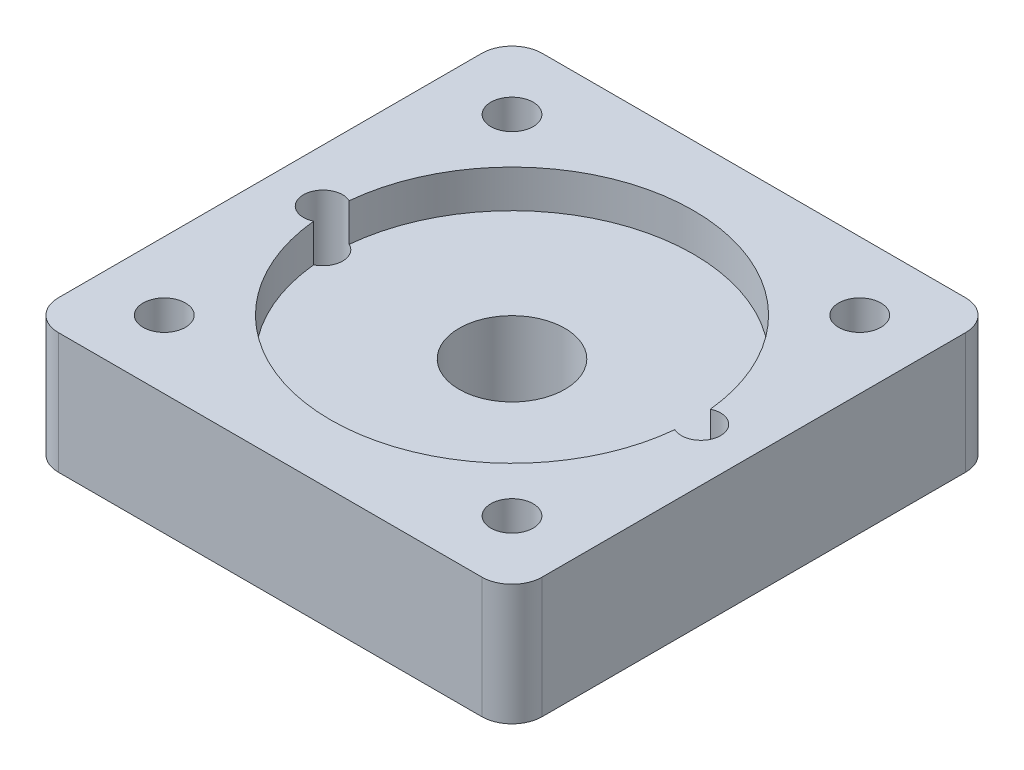
ISO-10303-21;
HEADER;
FILE_DESCRIPTION(('STEP AP214'),'2;1');
FILE_NAME('part.step','',(''),(''),'','','');
FILE_SCHEMA(('AUTOMOTIVE_DESIGN { 1 0 10303 214 1 1 1 1 }'));
ENDSEC;
DATA;
#1=APPLICATION_CONTEXT('core data for automotive mechanical design processes');
#2=APPLICATION_PROTOCOL_DEFINITION('international standard','automotive_design',2000,#1);
#3=PRODUCT_CONTEXT('',#1,'mechanical');
#4=PRODUCT('Part','Part','',(#3));
#5=PRODUCT_RELATED_PRODUCT_CATEGORY('part','',(#4));
#6=PRODUCT_DEFINITION_FORMATION('','',#4);
#7=PRODUCT_DEFINITION_CONTEXT('part definition',#1,'design');
#8=PRODUCT_DEFINITION('design','',#6,#7);
#9=PRODUCT_DEFINITION_SHAPE('','',#8);
#10=(LENGTH_UNIT() NAMED_UNIT(*) SI_UNIT(.MILLI.,.METRE.));
#11=(NAMED_UNIT(*) PLANE_ANGLE_UNIT() SI_UNIT($,.RADIAN.));
#12=(NAMED_UNIT(*) SI_UNIT($,.STERADIAN.) SOLID_ANGLE_UNIT());
#13=UNCERTAINTY_MEASURE_WITH_UNIT(LENGTH_MEASURE(1.E-05),#10,'distance_accuracy_value','');
#14=(GEOMETRIC_REPRESENTATION_CONTEXT(3) GLOBAL_UNCERTAINTY_ASSIGNED_CONTEXT((#13)) GLOBAL_UNIT_ASSIGNED_CONTEXT((#10,
#11,#12)) REPRESENTATION_CONTEXT('',''));
#15=CARTESIAN_POINT('',(0.,0.,0.));
#16=DIRECTION('',(0.,0.,1.));
#17=DIRECTION('',(1.,0.,0.));
#18=AXIS2_PLACEMENT_3D('',#15,#16,#17);
#19=CARTESIAN_POINT('',(4.5,8.,-27.5));
#20=DIRECTION('',(0.,-1.,0.));
#21=DIRECTION('',(0.,0.,-1.));
#22=AXIS2_PLACEMENT_3D('',#19,#20,#21);
#23=CYLINDRICAL_SURFACE('',#22,1.4);
#24=CARTESIAN_POINT('',(4.5,8.,-27.5));
#25=DIRECTION('',(0.,1.,0.));
#26=DIRECTION('',(0.,0.,1.));
#27=AXIS2_PLACEMENT_3D('',#24,#25,#26);
#28=CIRCLE('',#27,1.4);
#29=CARTESIAN_POINT('',(4.5,8.,-26.1));
#30=VERTEX_POINT('',#29);
#31=EDGE_CURVE('E188',#30,#30,#28,.T.);
#32=ORIENTED_EDGE('',*,*,#31,.T.);
#33=EDGE_LOOP('',(#32));
#34=FACE_BOUND('',#33,.T.);
#35=CARTESIAN_POINT('',(4.5,3.,-27.5));
#36=DIRECTION('',(0.,-1.,0.));
#37=DIRECTION('',(0.,0.,-1.));
#38=AXIS2_PLACEMENT_3D('',#35,#36,#37);
#39=CIRCLE('',#38,1.4);
#40=CARTESIAN_POINT('',(4.5,3.,-28.9));
#41=VERTEX_POINT('',#40);
#42=EDGE_CURVE('E48',#41,#41,#39,.T.);
#43=ORIENTED_EDGE('',*,*,#42,.T.);
#44=EDGE_LOOP('',(#43));
#45=FACE_BOUND('',#44,.T.);
#46=ADVANCED_FACE('F44',(#34,#45),#23,.F.);
#47=CARTESIAN_POINT('',(27.5,8.,-27.5));
#48=DIRECTION('',(0.,-1.,0.));
#49=DIRECTION('',(0.,0.,-1.));
#50=AXIS2_PLACEMENT_3D('',#47,#48,#49);
#51=CYLINDRICAL_SURFACE('',#50,1.4);
#52=CARTESIAN_POINT('',(27.5,8.,-27.5));
#53=DIRECTION('',(0.,1.,0.));
#54=DIRECTION('',(0.,0.,-1.));
#55=AXIS2_PLACEMENT_3D('',#52,#53,#54);
#56=CIRCLE('',#55,1.4);
#57=CARTESIAN_POINT('',(27.5,8.,-28.9));
#58=VERTEX_POINT('',#57);
#59=EDGE_CURVE('E184',#58,#58,#56,.T.);
#60=ORIENTED_EDGE('',*,*,#59,.T.);
#61=EDGE_LOOP('',(#60));
#62=FACE_BOUND('',#61,.T.);
#63=CARTESIAN_POINT('',(27.5,3.,-27.5));
#64=DIRECTION('',(0.,-1.,0.));
#65=DIRECTION('',(0.,0.,-1.));
#66=AXIS2_PLACEMENT_3D('',#63,#64,#65);
#67=CIRCLE('',#66,1.4);
#68=CARTESIAN_POINT('',(27.5,3.,-28.9));
#69=VERTEX_POINT('',#68);
#70=EDGE_CURVE('E288',#69,#69,#67,.T.);
#71=ORIENTED_EDGE('',*,*,#70,.T.);
#72=EDGE_LOOP('',(#71));
#73=FACE_BOUND('',#72,.T.);
#74=ADVANCED_FACE('F378',(#62,#73),#51,.F.);
#75=CARTESIAN_POINT('',(27.5,8.,-4.5));
#76=DIRECTION('',(0.,-1.,0.));
#77=DIRECTION('',(0.,0.,-1.));
#78=AXIS2_PLACEMENT_3D('',#75,#76,#77);
#79=CYLINDRICAL_SURFACE('',#78,1.4);
#80=CARTESIAN_POINT('',(27.5,8.,-4.5));
#81=DIRECTION('',(0.,1.,0.));
#82=DIRECTION('',(0.,0.,1.));
#83=AXIS2_PLACEMENT_3D('',#80,#81,#82);
#84=CIRCLE('',#83,1.4);
#85=CARTESIAN_POINT('',(27.5,8.,-3.1));
#86=VERTEX_POINT('',#85);
#87=EDGE_CURVE('E173',#86,#86,#84,.T.);
#88=ORIENTED_EDGE('',*,*,#87,.T.);
#89=EDGE_LOOP('',(#88));
#90=FACE_BOUND('',#89,.T.);
#91=CARTESIAN_POINT('',(27.5,3.,-4.5));
#92=DIRECTION('',(0.,-1.,0.));
#93=DIRECTION('',(0.,0.,-1.));
#94=AXIS2_PLACEMENT_3D('',#91,#92,#93);
#95=CIRCLE('',#94,1.4);
#96=CARTESIAN_POINT('',(27.5,3.,-5.9));
#97=VERTEX_POINT('',#96);
#98=EDGE_CURVE('E284',#97,#97,#95,.T.);
#99=ORIENTED_EDGE('',*,*,#98,.T.);
#100=EDGE_LOOP('',(#99));
#101=FACE_BOUND('',#100,.T.);
#102=ADVANCED_FACE('F385',(#90,#101),#79,.F.);
#103=CARTESIAN_POINT('',(4.5,8.,-4.5));
#104=DIRECTION('',(0.,-1.,0.));
#105=DIRECTION('',(0.,0.,-1.));
#106=AXIS2_PLACEMENT_3D('',#103,#104,#105);
#107=CYLINDRICAL_SURFACE('',#106,1.4);
#108=CARTESIAN_POINT('',(4.5,8.,-4.5));
#109=DIRECTION('',(0.,1.,0.));
#110=DIRECTION('',(0.,0.,-1.));
#111=AXIS2_PLACEMENT_3D('',#108,#109,#110);
#112=CIRCLE('',#111,1.4);
#113=CARTESIAN_POINT('',(4.5,8.,-5.9));
#114=VERTEX_POINT('',#113);
#115=EDGE_CURVE('E167',#114,#114,#112,.T.);
#116=ORIENTED_EDGE('',*,*,#115,.T.);
#117=EDGE_LOOP('',(#116));
#118=FACE_BOUND('',#117,.T.);
#119=CARTESIAN_POINT('',(4.5,3.,-4.5));
#120=DIRECTION('',(0.,-1.,0.));
#121=DIRECTION('',(0.,0.,-1.));
#122=AXIS2_PLACEMENT_3D('',#119,#120,#121);
#123=CIRCLE('',#122,1.4);
#124=CARTESIAN_POINT('',(4.5,3.,-5.9));
#125=VERTEX_POINT('',#124);
#126=EDGE_CURVE('E280',#125,#125,#123,.T.);
#127=ORIENTED_EDGE('',*,*,#126,.T.);
#128=EDGE_LOOP('',(#127));
#129=FACE_BOUND('',#128,.T.);
#130=ADVANCED_FACE('F353',(#118,#129),#107,.F.);
#131=CARTESIAN_POINT('',(16.,8.,-16.));
#132=DIRECTION('',(0.,-1.,0.));
#133=DIRECTION('',(0.,0.,-1.));
#134=AXIS2_PLACEMENT_3D('',#131,#132,#133);
#135=CYLINDRICAL_SURFACE('',#134,3.5);
#136=CARTESIAN_POINT('',(16.,0.,-16.));
#137=DIRECTION('',(0.,1.,0.));
#138=DIRECTION('',(0.,0.,1.));
#139=AXIS2_PLACEMENT_3D('',#136,#137,#138);
#140=CIRCLE('',#139,3.5);
#141=CARTESIAN_POINT('',(16.,0.,-12.5));
#142=VERTEX_POINT('',#141);
#143=EDGE_CURVE('E176',#142,#142,#140,.T.);
#144=ORIENTED_EDGE('',*,*,#143,.F.);
#145=EDGE_LOOP('',(#144));
#146=FACE_BOUND('',#145,.T.);
#147=CARTESIAN_POINT('',(16.,5.5,-16.));
#148=DIRECTION('',(0.,1.,0.));
#149=DIRECTION('',(0.,0.,1.));
#150=AXIS2_PLACEMENT_3D('',#147,#148,#149);
#151=CIRCLE('',#150,3.5);
#152=CARTESIAN_POINT('',(16.,5.5,-12.5));
#153=VERTEX_POINT('',#152);
#154=EDGE_CURVE('E227',#153,#153,#151,.T.);
#155=ORIENTED_EDGE('',*,*,#154,.T.);
#156=EDGE_LOOP('',(#155));
#157=FACE_BOUND('',#156,.T.);
#158=ADVANCED_FACE('F350',(#146,#157),#135,.F.);
#159=CARTESIAN_POINT('',(0.,8.,0.));
#160=DIRECTION('',(0.,-1.,0.));
#161=DIRECTION('',(0.,0.,-1.));
#162=AXIS2_PLACEMENT_3D('',#159,#160,#161);
#163=PLANE('',#162);
#164=DIRECTION('',(0.,0.,-1.));
#165=VECTOR('',#164,1.);
#166=CARTESIAN_POINT('',(32.,8.,0.));
#167=LINE('',#166,#165);
#168=CARTESIAN_POINT('',(32.,8.,-2.));
#169=VERTEX_POINT('',#168);
#170=CARTESIAN_POINT('',(32.,8.,-30.));
#171=VERTEX_POINT('',#170);
#172=EDGE_CURVE('E207',#169,#171,#167,.T.);
#173=ORIENTED_EDGE('',*,*,#172,.T.);
#174=CARTESIAN_POINT('',(30.,8.,-30.));
#175=DIRECTION('',(0.,-1.,0.));
#176=DIRECTION('',(0.,0.,-1.));
#177=AXIS2_PLACEMENT_3D('',#174,#175,#176);
#178=CIRCLE('',#177,2.);
#179=CARTESIAN_POINT('',(30.,8.,-32.));
#180=VERTEX_POINT('',#179);
#181=EDGE_CURVE('E268',#171,#180,#178,.F.);
#182=ORIENTED_EDGE('',*,*,#181,.T.);
#183=DIRECTION('',(-1.,0.,0.));
#184=VECTOR('',#183,1.);
#185=CARTESIAN_POINT('',(0.,8.,-32.));
#186=LINE('',#185,#184);
#187=CARTESIAN_POINT('',(2.,8.,-32.));
#188=VERTEX_POINT('',#187);
#189=EDGE_CURVE('E161',#180,#188,#186,.T.);
#190=ORIENTED_EDGE('',*,*,#189,.T.);
#191=CARTESIAN_POINT('',(2.,8.,-30.));
#192=DIRECTION('',(0.,-1.,0.));
#193=DIRECTION('',(0.,0.,-1.));
#194=AXIS2_PLACEMENT_3D('',#191,#192,#193);
#195=CIRCLE('',#194,2.);
#196=CARTESIAN_POINT('',(0.,8.,-30.));
#197=VERTEX_POINT('',#196);
#198=EDGE_CURVE('E260',#188,#197,#195,.F.);
#199=ORIENTED_EDGE('',*,*,#198,.T.);
#200=DIRECTION('',(0.,0.,1.));
#201=VECTOR('',#200,1.);
#202=CARTESIAN_POINT('',(0.,8.,0.));
#203=LINE('',#202,#201);
#204=CARTESIAN_POINT('',(0.,8.,-2.));
#205=VERTEX_POINT('',#204);
#206=EDGE_CURVE('E200',#197,#205,#203,.T.);
#207=ORIENTED_EDGE('',*,*,#206,.T.);
#208=CARTESIAN_POINT('',(2.,8.,-2.));
#209=DIRECTION('',(0.,-1.,0.));
#210=DIRECTION('',(0.,0.,-1.));
#211=AXIS2_PLACEMENT_3D('',#208,#209,#210);
#212=CIRCLE('',#211,2.);
#213=CARTESIAN_POINT('',(2.,8.,0.));
#214=VERTEX_POINT('',#213);
#215=EDGE_CURVE('E69',#205,#214,#212,.F.);
#216=ORIENTED_EDGE('',*,*,#215,.T.);
#217=DIRECTION('',(1.,0.,0.));
#218=VECTOR('',#217,1.);
#219=CARTESIAN_POINT('',(0.,8.,0.));
#220=LINE('',#219,#218);
#221=CARTESIAN_POINT('',(30.,8.,0.));
#222=VERTEX_POINT('',#221);
#223=EDGE_CURVE('E203',#214,#222,#220,.T.);
#224=ORIENTED_EDGE('',*,*,#223,.T.);
#225=CARTESIAN_POINT('',(30.,8.,-2.));
#226=DIRECTION('',(0.,-1.,0.));
#227=DIRECTION('',(0.,0.,-1.));
#228=AXIS2_PLACEMENT_3D('',#225,#226,#227);
#229=CIRCLE('',#228,2.);
#230=EDGE_CURVE('E265',#222,#169,#229,.F.);
#231=ORIENTED_EDGE('',*,*,#230,.T.);
#232=EDGE_LOOP('',(#173,#182,#190,#199,#207,#216,#224,#231));
#233=FACE_BOUND('',#232,.T.);
#234=CARTESIAN_POINT('',(28.5,8.,-16.));
#235=DIRECTION('',(0.,1.,0.));
#236=DIRECTION('',(0.,0.,-1.));
#237=AXIS2_PLACEMENT_3D('',#234,#235,#236);
#238=CIRCLE('',#237,1.3);
#239=CARTESIAN_POINT('',(27.9424,8.,-14.825656677117));
#240=VERTEX_POINT('',#239);
#241=CARTESIAN_POINT('',(27.9424,8.,-17.174343322883));
#242=VERTEX_POINT('',#241);
#243=EDGE_CURVE('E157',#240,#242,#238,.T.);
#244=ORIENTED_EDGE('',*,*,#243,.F.);
#245=CARTESIAN_POINT('',(16.,8.,-16.));
#246=DIRECTION('',(0.,1.,0.));
#247=DIRECTION('',(0.,0.,1.));
#248=AXIS2_PLACEMENT_3D('',#245,#246,#247);
#249=CIRCLE('',#248,12.);
#250=CARTESIAN_POINT('',(4.0576,8.,-14.825656677117));
#251=VERTEX_POINT('',#250);
#252=EDGE_CURVE('E137',#251,#240,#249,.T.);
#253=ORIENTED_EDGE('',*,*,#252,.F.);
#254=CARTESIAN_POINT('',(3.5,8.,-16.));
#255=DIRECTION('',(0.,1.,0.));
#256=DIRECTION('',(0.,0.,1.));
#257=AXIS2_PLACEMENT_3D('',#254,#255,#256);
#258=CIRCLE('',#257,1.3);
#259=CARTESIAN_POINT('',(4.0576,8.,-17.174343322883));
#260=VERTEX_POINT('',#259);
#261=EDGE_CURVE('E193',#260,#251,#258,.T.);
#262=ORIENTED_EDGE('',*,*,#261,.F.);
#263=EDGE_CURVE('E150',#242,#260,#249,.T.);
#264=ORIENTED_EDGE('',*,*,#263,.F.);
#265=EDGE_LOOP('',(#244,#253,#262,#264));
#266=FACE_BOUND('',#265,.T.);
#267=ORIENTED_EDGE('',*,*,#31,.F.);
#268=EDGE_LOOP('',(#267));
#269=FACE_BOUND('',#268,.T.);
#270=ORIENTED_EDGE('',*,*,#59,.F.);
#271=EDGE_LOOP('',(#270));
#272=FACE_BOUND('',#271,.T.);
#273=ORIENTED_EDGE('',*,*,#87,.F.);
#274=EDGE_LOOP('',(#273));
#275=FACE_BOUND('',#274,.T.);
#276=ORIENTED_EDGE('',*,*,#115,.F.);
#277=EDGE_LOOP('',(#276));
#278=FACE_BOUND('',#277,.T.);
#279=ADVANCED_FACE('F164',(#233,#266,#269,#272,#275,#278),#163,.F.);
#280=CARTESIAN_POINT('',(0.,0.,0.));
#281=DIRECTION('',(0.,-1.,0.));
#282=DIRECTION('',(0.,0.,-1.));
#283=AXIS2_PLACEMENT_3D('',#280,#281,#282);
#284=PLANE('',#283);
#285=CARTESIAN_POINT('',(4.5,0.,-4.5));
#286=DIRECTION('',(0.,-1.,0.));
#287=DIRECTION('',(0.,0.,-1.));
#288=AXIS2_PLACEMENT_3D('',#285,#286,#287);
#289=CIRCLE('',#288,3.);
#290=CARTESIAN_POINT('',(4.5,0.,-7.5));
#291=VERTEX_POINT('',#290);
#292=EDGE_CURVE('E309',#291,#291,#289,.T.);
#293=ORIENTED_EDGE('',*,*,#292,.F.);
#294=EDGE_LOOP('',(#293));
#295=FACE_BOUND('',#294,.T.);
#296=CARTESIAN_POINT('',(4.5,0.,-27.5));
#297=DIRECTION('',(0.,-1.,0.));
#298=DIRECTION('',(0.,0.,-1.));
#299=AXIS2_PLACEMENT_3D('',#296,#297,#298);
#300=CIRCLE('',#299,3.);
#301=CARTESIAN_POINT('',(4.5,0.,-30.5));
#302=VERTEX_POINT('',#301);
#303=EDGE_CURVE('E308',#302,#302,#300,.T.);
#304=ORIENTED_EDGE('',*,*,#303,.F.);
#305=EDGE_LOOP('',(#304));
#306=FACE_BOUND('',#305,.T.);
#307=CARTESIAN_POINT('',(27.5,0.,-27.5));
#308=DIRECTION('',(0.,-1.,0.));
#309=DIRECTION('',(0.,0.,-1.));
#310=AXIS2_PLACEMENT_3D('',#307,#308,#309);
#311=CIRCLE('',#310,3.);
#312=CARTESIAN_POINT('',(27.5,0.,-30.5));
#313=VERTEX_POINT('',#312);
#314=EDGE_CURVE('E331',#313,#313,#311,.T.);
#315=ORIENTED_EDGE('',*,*,#314,.F.);
#316=EDGE_LOOP('',(#315));
#317=FACE_BOUND('',#316,.T.);
#318=CARTESIAN_POINT('',(27.5,0.,-4.5));
#319=DIRECTION('',(0.,-1.,0.));
#320=DIRECTION('',(0.,0.,-1.));
#321=AXIS2_PLACEMENT_3D('',#318,#319,#320);
#322=CIRCLE('',#321,3.);
#323=CARTESIAN_POINT('',(27.5,0.,-7.5));
#324=VERTEX_POINT('',#323);
#325=EDGE_CURVE('E327',#324,#324,#322,.T.);
#326=ORIENTED_EDGE('',*,*,#325,.F.);
#327=EDGE_LOOP('',(#326));
#328=FACE_BOUND('',#327,.T.);
#329=CARTESIAN_POINT('',(28.5,0.,-16.));
#330=DIRECTION('',(0.,1.,0.));
#331=DIRECTION('',(0.,0.,-1.));
#332=AXIS2_PLACEMENT_3D('',#329,#330,#331);
#333=CIRCLE('',#332,1.3);
#334=CARTESIAN_POINT('',(28.5,0.,-17.3));
#335=VERTEX_POINT('',#334);
#336=EDGE_CURVE('E168',#335,#335,#333,.T.);
#337=ORIENTED_EDGE('',*,*,#336,.T.);
#338=EDGE_LOOP('',(#337));
#339=FACE_BOUND('',#338,.T.);
#340=DIRECTION('',(-1.,0.,0.));
#341=VECTOR('',#340,1.);
#342=CARTESIAN_POINT('',(0.,0.,-32.));
#343=LINE('',#342,#341);
#344=CARTESIAN_POINT('',(30.,0.,-32.));
#345=VERTEX_POINT('',#344);
#346=CARTESIAN_POINT('',(2.,0.,-32.));
#347=VERTEX_POINT('',#346);
#348=EDGE_CURVE('E204',#345,#347,#343,.T.);
#349=ORIENTED_EDGE('',*,*,#348,.F.);
#350=CARTESIAN_POINT('',(30.,0.,-30.));
#351=DIRECTION('',(0.,-1.,0.));
#352=DIRECTION('',(0.,0.,-1.));
#353=AXIS2_PLACEMENT_3D('',#350,#351,#352);
#354=CIRCLE('',#353,2.);
#355=CARTESIAN_POINT('',(32.,0.,-30.));
#356=VERTEX_POINT('',#355);
#357=EDGE_CURVE('E250',#345,#356,#354,.T.);
#358=ORIENTED_EDGE('',*,*,#357,.T.);
#359=DIRECTION('',(0.,0.,-1.));
#360=VECTOR('',#359,1.);
#361=CARTESIAN_POINT('',(32.,0.,0.));
#362=LINE('',#361,#360);
#363=CARTESIAN_POINT('',(32.,0.,-2.));
#364=VERTEX_POINT('',#363);
#365=EDGE_CURVE('E220',#364,#356,#362,.T.);
#366=ORIENTED_EDGE('',*,*,#365,.F.);
#367=CARTESIAN_POINT('',(30.,0.,-2.));
#368=DIRECTION('',(0.,-1.,0.));
#369=DIRECTION('',(0.,0.,-1.));
#370=AXIS2_PLACEMENT_3D('',#367,#368,#369);
#371=CIRCLE('',#370,2.);
#372=CARTESIAN_POINT('',(30.,0.,0.));
#373=VERTEX_POINT('',#372);
#374=EDGE_CURVE('E247',#364,#373,#371,.T.);
#375=ORIENTED_EDGE('',*,*,#374,.T.);
#376=DIRECTION('',(1.,0.,0.));
#377=VECTOR('',#376,1.);
#378=CARTESIAN_POINT('',(0.,0.,0.));
#379=LINE('',#378,#377);
#380=CARTESIAN_POINT('',(2.,0.,0.));
#381=VERTEX_POINT('',#380);
#382=EDGE_CURVE('E217',#381,#373,#379,.T.);
#383=ORIENTED_EDGE('',*,*,#382,.F.);
#384=CARTESIAN_POINT('',(2.,0.,-2.));
#385=DIRECTION('',(0.,-1.,0.));
#386=DIRECTION('',(0.,0.,-1.));
#387=AXIS2_PLACEMENT_3D('',#384,#385,#386);
#388=CIRCLE('',#387,2.);
#389=CARTESIAN_POINT('',(0.,0.,-2.));
#390=VERTEX_POINT('',#389);
#391=EDGE_CURVE('E244',#381,#390,#388,.T.);
#392=ORIENTED_EDGE('',*,*,#391,.T.);
#393=DIRECTION('',(0.,0.,1.));
#394=VECTOR('',#393,1.);
#395=CARTESIAN_POINT('',(0.,0.,0.));
#396=LINE('',#395,#394);
#397=CARTESIAN_POINT('',(0.,0.,-30.));
#398=VERTEX_POINT('',#397);
#399=EDGE_CURVE('E196',#398,#390,#396,.T.);
#400=ORIENTED_EDGE('',*,*,#399,.F.);
#401=CARTESIAN_POINT('',(2.,0.,-30.));
#402=DIRECTION('',(0.,-1.,0.));
#403=DIRECTION('',(0.,0.,-1.));
#404=AXIS2_PLACEMENT_3D('',#401,#402,#403);
#405=CIRCLE('',#404,2.);
#406=EDGE_CURVE('E241',#398,#347,#405,.T.);
#407=ORIENTED_EDGE('',*,*,#406,.T.);
#408=EDGE_LOOP('',(#349,#358,#366,#375,#383,#392,#400,#407));
#409=FACE_BOUND('',#408,.T.);
#410=CARTESIAN_POINT('',(3.5,0.,-16.));
#411=DIRECTION('',(0.,1.,0.));
#412=DIRECTION('',(0.,0.,1.));
#413=AXIS2_PLACEMENT_3D('',#410,#411,#412);
#414=CIRCLE('',#413,1.3);
#415=CARTESIAN_POINT('',(3.5,0.,-14.7));
#416=VERTEX_POINT('',#415);
#417=EDGE_CURVE('E192',#416,#416,#414,.T.);
#418=ORIENTED_EDGE('',*,*,#417,.T.);
#419=EDGE_LOOP('',(#418));
#420=FACE_BOUND('',#419,.T.);
#421=ORIENTED_EDGE('',*,*,#143,.T.);
#422=EDGE_LOOP('',(#421));
#423=FACE_BOUND('',#422,.T.);
#424=ADVANCED_FACE('F348',(#295,#306,#317,#328,#339,#409,#420,#423),#284,.T.);
#425=CARTESIAN_POINT('',(0.,8.,0.));
#426=DIRECTION('',(1.,0.,0.));
#427=DIRECTION('',(0.,0.,-1.));
#428=AXIS2_PLACEMENT_3D('',#425,#426,#427);
#429=PLANE('',#428);
#430=ORIENTED_EDGE('',*,*,#399,.T.);
#431=DIRECTION('',(0.,-1.,0.));
#432=VECTOR('',#431,1.);
#433=CARTESIAN_POINT('',(0.,8.,-2.));
#434=LINE('',#433,#432);
#435=EDGE_CURVE('E11',#390,#205,#434,.F.);
#436=ORIENTED_EDGE('',*,*,#435,.T.);
#437=ORIENTED_EDGE('',*,*,#206,.F.);
#438=DIRECTION('',(0.,-1.,0.));
#439=VECTOR('',#438,1.);
#440=CARTESIAN_POINT('',(0.,8.,-30.));
#441=LINE('',#440,#439);
#442=EDGE_CURVE('E54',#197,#398,#441,.T.);
#443=ORIENTED_EDGE('',*,*,#442,.T.);
#444=EDGE_LOOP('',(#430,#436,#437,#443));
#445=FACE_BOUND('',#444,.T.);
#446=ADVANCED_FACE('F397',(#445),#429,.F.);
#447=CARTESIAN_POINT('',(0.,8.,0.));
#448=DIRECTION('',(0.,0.,-1.));
#449=DIRECTION('',(-1.,0.,0.));
#450=AXIS2_PLACEMENT_3D('',#447,#448,#449);
#451=PLANE('',#450);
#452=ORIENTED_EDGE('',*,*,#382,.T.);
#453=DIRECTION('',(0.,-1.,0.));
#454=VECTOR('',#453,1.);
#455=CARTESIAN_POINT('',(30.,8.,0.));
#456=LINE('',#455,#454);
#457=EDGE_CURVE('E62',#373,#222,#456,.F.);
#458=ORIENTED_EDGE('',*,*,#457,.T.);
#459=ORIENTED_EDGE('',*,*,#223,.F.);
#460=DIRECTION('',(0.,-1.,0.));
#461=VECTOR('',#460,1.);
#462=CARTESIAN_POINT('',(2.,8.,0.));
#463=LINE('',#462,#461);
#464=EDGE_CURVE('E271',#214,#381,#463,.T.);
#465=ORIENTED_EDGE('',*,*,#464,.T.);
#466=EDGE_LOOP('',(#452,#458,#459,#465));
#467=FACE_BOUND('',#466,.T.);
#468=ADVANCED_FACE('F405',(#467),#451,.F.);
#469=CARTESIAN_POINT('',(32.,8.,0.));
#470=DIRECTION('',(-1.,0.,0.));
#471=DIRECTION('',(0.,0.,1.));
#472=AXIS2_PLACEMENT_3D('',#469,#470,#471);
#473=PLANE('',#472);
#474=ORIENTED_EDGE('',*,*,#365,.T.);
#475=DIRECTION('',(0.,-1.,0.));
#476=VECTOR('',#475,1.);
#477=CARTESIAN_POINT('',(32.,8.,-30.));
#478=LINE('',#477,#476);
#479=EDGE_CURVE('E257',#356,#171,#478,.F.);
#480=ORIENTED_EDGE('',*,*,#479,.T.);
#481=ORIENTED_EDGE('',*,*,#172,.F.);
#482=DIRECTION('',(0.,-1.,0.));
#483=VECTOR('',#482,1.);
#484=CARTESIAN_POINT('',(32.,8.,-2.));
#485=LINE('',#484,#483);
#486=EDGE_CURVE('E253',#169,#364,#485,.T.);
#487=ORIENTED_EDGE('',*,*,#486,.T.);
#488=EDGE_LOOP('',(#474,#480,#481,#487));
#489=FACE_BOUND('',#488,.T.);
#490=ADVANCED_FACE('F401',(#489),#473,.F.);
#491=CARTESIAN_POINT('',(0.,8.,-32.));
#492=DIRECTION('',(0.,0.,1.));
#493=DIRECTION('',(1.,0.,0.));
#494=AXIS2_PLACEMENT_3D('',#491,#492,#493);
#495=PLANE('',#494);
#496=ORIENTED_EDGE('',*,*,#189,.F.);
#497=DIRECTION('',(0.,-1.,0.));
#498=VECTOR('',#497,1.);
#499=CARTESIAN_POINT('',(30.,8.,-32.));
#500=LINE('',#499,#498);
#501=EDGE_CURVE('E237',#180,#345,#500,.T.);
#502=ORIENTED_EDGE('',*,*,#501,.T.);
#503=ORIENTED_EDGE('',*,*,#348,.T.);
#504=DIRECTION('',(0.,-1.,0.));
#505=VECTOR('',#504,1.);
#506=CARTESIAN_POINT('',(2.,8.,-32.));
#507=LINE('',#506,#505);
#508=EDGE_CURVE('E234',#347,#188,#507,.F.);
#509=ORIENTED_EDGE('',*,*,#508,.T.);
#510=EDGE_LOOP('',(#496,#502,#503,#509));
#511=FACE_BOUND('',#510,.T.);
#512=ADVANCED_FACE('F392',(#511),#495,.F.);
#513=CARTESIAN_POINT('',(3.5,8.,-16.));
#514=DIRECTION('',(0.,-1.,0.));
#515=DIRECTION('',(0.,0.,-1.));
#516=AXIS2_PLACEMENT_3D('',#513,#514,#515);
#517=CYLINDRICAL_SURFACE('',#516,1.3);
#518=DIRECTION('',(0.,1.,0.));
#519=VECTOR('',#518,1.);
#520=CARTESIAN_POINT('',(4.0576,6.75,-14.825656677117));
#521=LINE('',#520,#519);
#522=CARTESIAN_POINT('',(4.0576,5.5,-14.825656677117));
#523=VERTEX_POINT('',#522);
#524=EDGE_CURVE('E144',#523,#251,#521,.T.);
#525=ORIENTED_EDGE('',*,*,#524,.F.);
#526=CARTESIAN_POINT('',(3.5,5.5,-16.));
#527=DIRECTION('',(0.,1.,0.));
#528=DIRECTION('',(0.,0.,1.));
#529=AXIS2_PLACEMENT_3D('',#526,#527,#528);
#530=CIRCLE('',#529,1.3);
#531=CARTESIAN_POINT('',(4.0576,5.5,-17.174343322883));
#532=VERTEX_POINT('',#531);
#533=EDGE_CURVE('E337',#523,#532,#530,.T.);
#534=ORIENTED_EDGE('',*,*,#533,.T.);
#535=DIRECTION('',(0.,1.,0.));
#536=VECTOR('',#535,1.);
#537=CARTESIAN_POINT('',(4.0576,6.75,-17.174343322883));
#538=LINE('',#537,#536);
#539=EDGE_CURVE('E341',#260,#532,#538,.F.);
#540=ORIENTED_EDGE('',*,*,#539,.F.);
#541=ORIENTED_EDGE('',*,*,#261,.T.);
#542=EDGE_LOOP('',(#525,#534,#540,#541));
#543=FACE_BOUND('',#542,.T.);
#544=ORIENTED_EDGE('',*,*,#417,.F.);
#545=EDGE_LOOP('',(#544));
#546=FACE_BOUND('',#545,.T.);
#547=ADVANCED_FACE('F366',(#543,#546),#517,.F.);
#548=CARTESIAN_POINT('',(28.5,8.,-16.));
#549=DIRECTION('',(0.,-1.,0.));
#550=DIRECTION('',(0.,0.,-1.));
#551=AXIS2_PLACEMENT_3D('',#548,#549,#550);
#552=CYLINDRICAL_SURFACE('',#551,1.3);
#553=DIRECTION('',(0.,1.,0.));
#554=VECTOR('',#553,1.);
#555=CARTESIAN_POINT('',(27.9424,6.75,-17.174343322883));
#556=LINE('',#555,#554);
#557=CARTESIAN_POINT('',(27.9424,5.5,-17.174343322883));
#558=VERTEX_POINT('',#557);
#559=EDGE_CURVE('E160',#558,#242,#556,.T.);
#560=ORIENTED_EDGE('',*,*,#559,.F.);
#561=CARTESIAN_POINT('',(28.5,5.5,-16.));
#562=DIRECTION('',(0.,1.,0.));
#563=DIRECTION('',(0.,0.,1.));
#564=AXIS2_PLACEMENT_3D('',#561,#562,#563);
#565=CIRCLE('',#564,1.3);
#566=CARTESIAN_POINT('',(27.9424,5.5,-14.825656677117));
#567=VERTEX_POINT('',#566);
#568=EDGE_CURVE('E158',#558,#567,#565,.T.);
#569=ORIENTED_EDGE('',*,*,#568,.T.);
#570=DIRECTION('',(0.,1.,0.));
#571=VECTOR('',#570,1.);
#572=CARTESIAN_POINT('',(27.9424,6.75,-14.825656677117));
#573=LINE('',#572,#571);
#574=EDGE_CURVE('E141',#240,#567,#573,.F.);
#575=ORIENTED_EDGE('',*,*,#574,.F.);
#576=ORIENTED_EDGE('',*,*,#243,.T.);
#577=EDGE_LOOP('',(#560,#569,#575,#576));
#578=FACE_BOUND('',#577,.T.);
#579=ORIENTED_EDGE('',*,*,#336,.F.);
#580=EDGE_LOOP('',(#579));
#581=FACE_BOUND('',#580,.T.);
#582=ADVANCED_FACE('F155',(#578,#581),#552,.F.);
#583=CARTESIAN_POINT('',(16.,5.5,-16.));
#584=DIRECTION('',(0.,1.,0.));
#585=DIRECTION('',(0.,0.,1.));
#586=AXIS2_PLACEMENT_3D('',#583,#584,#585);
#587=CYLINDRICAL_SURFACE('',#586,12.);
#588=ORIENTED_EDGE('',*,*,#524,.T.);
#589=ORIENTED_EDGE('',*,*,#252,.T.);
#590=ORIENTED_EDGE('',*,*,#574,.T.);
#591=CARTESIAN_POINT('',(16.,5.5,-16.));
#592=DIRECTION('',(0.,1.,0.));
#593=DIRECTION('',(0.,0.,1.));
#594=AXIS2_PLACEMENT_3D('',#591,#592,#593);
#595=CIRCLE('',#594,12.);
#596=EDGE_CURVE('E332',#523,#567,#595,.T.);
#597=ORIENTED_EDGE('',*,*,#596,.F.);
#598=EDGE_LOOP('',(#588,#589,#590,#597));
#599=FACE_BOUND('',#598,.T.);
#600=ADVANCED_FACE('F139',(#599),#587,.F.);
#601=ORIENTED_EDGE('',*,*,#539,.T.);
#602=EDGE_CURVE('E230',#558,#532,#595,.T.);
#603=ORIENTED_EDGE('',*,*,#602,.F.);
#604=ORIENTED_EDGE('',*,*,#559,.T.);
#605=ORIENTED_EDGE('',*,*,#263,.T.);
#606=EDGE_LOOP('',(#601,#603,#604,#605));
#607=FACE_BOUND('',#606,.T.);
#608=ADVANCED_FACE('F361',(#607),#587,.F.);
#609=CARTESIAN_POINT('',(16.,5.5,-16.));
#610=DIRECTION('',(0.,1.,0.));
#611=DIRECTION('',(0.,0.,1.));
#612=AXIS2_PLACEMENT_3D('',#609,#610,#611);
#613=PLANE('',#612);
#614=ORIENTED_EDGE('',*,*,#154,.F.);
#615=EDGE_LOOP('',(#614));
#616=FACE_BOUND('',#615,.T.);
#617=ORIENTED_EDGE('',*,*,#596,.T.);
#618=ORIENTED_EDGE('',*,*,#568,.F.);
#619=ORIENTED_EDGE('',*,*,#602,.T.);
#620=ORIENTED_EDGE('',*,*,#533,.F.);
#621=EDGE_LOOP('',(#617,#618,#619,#620));
#622=FACE_BOUND('',#621,.T.);
#623=ADVANCED_FACE('F357',(#616,#622),#613,.T.);
#624=CARTESIAN_POINT('',(30.,8.,-30.));
#625=DIRECTION('',(0.,-1.,0.));
#626=DIRECTION('',(0.,0.,-1.));
#627=AXIS2_PLACEMENT_3D('',#624,#625,#626);
#628=CYLINDRICAL_SURFACE('',#627,2.);
#629=ORIENTED_EDGE('',*,*,#181,.F.);
#630=ORIENTED_EDGE('',*,*,#479,.F.);
#631=ORIENTED_EDGE('',*,*,#357,.F.);
#632=ORIENTED_EDGE('',*,*,#501,.F.);
#633=EDGE_LOOP('',(#629,#630,#631,#632));
#634=FACE_BOUND('',#633,.T.);
#635=ADVANCED_FACE('F360',(#634),#628,.T.);
#636=CARTESIAN_POINT('',(30.,8.,-2.));
#637=DIRECTION('',(0.,-1.,0.));
#638=DIRECTION('',(0.,0.,-1.));
#639=AXIS2_PLACEMENT_3D('',#636,#637,#638);
#640=CYLINDRICAL_SURFACE('',#639,2.);
#641=ORIENTED_EDGE('',*,*,#230,.F.);
#642=ORIENTED_EDGE('',*,*,#457,.F.);
#643=ORIENTED_EDGE('',*,*,#374,.F.);
#644=ORIENTED_EDGE('',*,*,#486,.F.);
#645=EDGE_LOOP('',(#641,#642,#643,#644));
#646=FACE_BOUND('',#645,.T.);
#647=ADVANCED_FACE('F414',(#646),#640,.T.);
#648=CARTESIAN_POINT('',(2.,8.,-2.));
#649=DIRECTION('',(0.,-1.,0.));
#650=DIRECTION('',(0.,0.,-1.));
#651=AXIS2_PLACEMENT_3D('',#648,#649,#650);
#652=CYLINDRICAL_SURFACE('',#651,2.);
#653=ORIENTED_EDGE('',*,*,#215,.F.);
#654=ORIENTED_EDGE('',*,*,#435,.F.);
#655=ORIENTED_EDGE('',*,*,#391,.F.);
#656=ORIENTED_EDGE('',*,*,#464,.F.);
#657=EDGE_LOOP('',(#653,#654,#655,#656));
#658=FACE_BOUND('',#657,.T.);
#659=ADVANCED_FACE('F417',(#658),#652,.T.);
#660=CARTESIAN_POINT('',(2.,8.,-30.));
#661=DIRECTION('',(0.,-1.,0.));
#662=DIRECTION('',(0.,0.,-1.));
#663=AXIS2_PLACEMENT_3D('',#660,#661,#662);
#664=CYLINDRICAL_SURFACE('',#663,2.);
#665=ORIENTED_EDGE('',*,*,#198,.F.);
#666=ORIENTED_EDGE('',*,*,#508,.F.);
#667=ORIENTED_EDGE('',*,*,#406,.F.);
#668=ORIENTED_EDGE('',*,*,#442,.F.);
#669=EDGE_LOOP('',(#665,#666,#667,#668));
#670=FACE_BOUND('',#669,.T.);
#671=ADVANCED_FACE('F46',(#670),#664,.T.);
#672=CARTESIAN_POINT('',(4.5,3.,-4.5));
#673=DIRECTION('',(0.,-1.,0.));
#674=DIRECTION('',(0.,0.,-1.));
#675=AXIS2_PLACEMENT_3D('',#672,#673,#674);
#676=CYLINDRICAL_SURFACE('',#675,3.);
#677=CARTESIAN_POINT('',(4.5,3.,-4.5));
#678=DIRECTION('',(0.,-1.,0.));
#679=DIRECTION('',(0.,0.,-1.));
#680=AXIS2_PLACEMENT_3D('',#677,#678,#679);
#681=CIRCLE('',#680,3.);
#682=CARTESIAN_POINT('',(4.5,3.,-7.5));
#683=VERTEX_POINT('',#682);
#684=EDGE_CURVE('E317',#683,#683,#681,.T.);
#685=ORIENTED_EDGE('',*,*,#684,.F.);
#686=EDGE_LOOP('',(#685));
#687=FACE_BOUND('',#686,.T.);
#688=ORIENTED_EDGE('',*,*,#292,.T.);
#689=EDGE_LOOP('',(#688));
#690=FACE_BOUND('',#689,.T.);
#691=ADVANCED_FACE('F423',(#687,#690),#676,.F.);
#692=CARTESIAN_POINT('',(4.5,3.,-4.5));
#693=DIRECTION('',(0.,-1.,0.));
#694=DIRECTION('',(0.,0.,-1.));
#695=AXIS2_PLACEMENT_3D('',#692,#693,#694);
#696=PLANE('',#695);
#697=ORIENTED_EDGE('',*,*,#126,.F.);
#698=EDGE_LOOP('',(#697));
#699=FACE_BOUND('',#698,.T.);
#700=ORIENTED_EDGE('',*,*,#684,.T.);
#701=EDGE_LOOP('',(#700));
#702=FACE_BOUND('',#701,.T.);
#703=ADVANCED_FACE('F448',(#699,#702),#696,.T.);
#704=CARTESIAN_POINT('',(27.5,3.,-4.5));
#705=DIRECTION('',(0.,-1.,0.));
#706=DIRECTION('',(0.,0.,-1.));
#707=AXIS2_PLACEMENT_3D('',#704,#705,#706);
#708=CYLINDRICAL_SURFACE('',#707,3.);
#709=CARTESIAN_POINT('',(27.5,3.,-4.5));
#710=DIRECTION('',(0.,-1.,0.));
#711=DIRECTION('',(0.,0.,-1.));
#712=AXIS2_PLACEMENT_3D('',#709,#710,#711);
#713=CIRCLE('',#712,3.);
#714=CARTESIAN_POINT('',(27.5,3.,-7.5));
#715=VERTEX_POINT('',#714);
#716=EDGE_CURVE('E285',#715,#715,#713,.T.);
#717=ORIENTED_EDGE('',*,*,#716,.F.);
#718=EDGE_LOOP('',(#717));
#719=FACE_BOUND('',#718,.T.);
#720=ORIENTED_EDGE('',*,*,#325,.T.);
#721=EDGE_LOOP('',(#720));
#722=FACE_BOUND('',#721,.T.);
#723=ADVANCED_FACE('F454',(#719,#722),#708,.F.);
#724=CARTESIAN_POINT('',(27.5,3.,-4.5));
#725=DIRECTION('',(0.,-1.,0.));
#726=DIRECTION('',(0.,0.,-1.));
#727=AXIS2_PLACEMENT_3D('',#724,#725,#726);
#728=PLANE('',#727);
#729=ORIENTED_EDGE('',*,*,#98,.F.);
#730=EDGE_LOOP('',(#729));
#731=FACE_BOUND('',#730,.T.);
#732=ORIENTED_EDGE('',*,*,#716,.T.);
#733=EDGE_LOOP('',(#732));
#734=FACE_BOUND('',#733,.T.);
#735=ADVANCED_FACE('F461',(#731,#734),#728,.T.);
#736=CARTESIAN_POINT('',(27.5,3.,-27.5));
#737=DIRECTION('',(0.,-1.,0.));
#738=DIRECTION('',(0.,0.,-1.));
#739=AXIS2_PLACEMENT_3D('',#736,#737,#738);
#740=CYLINDRICAL_SURFACE('',#739,3.);
#741=CARTESIAN_POINT('',(27.5,3.,-27.5));
#742=DIRECTION('',(0.,-1.,0.));
#743=DIRECTION('',(0.,0.,-1.));
#744=AXIS2_PLACEMENT_3D('',#741,#742,#743);
#745=CIRCLE('',#744,3.);
#746=CARTESIAN_POINT('',(27.5,3.,-30.5));
#747=VERTEX_POINT('',#746);
#748=EDGE_CURVE('E314',#747,#747,#745,.T.);
#749=ORIENTED_EDGE('',*,*,#748,.F.);
#750=EDGE_LOOP('',(#749));
#751=FACE_BOUND('',#750,.T.);
#752=ORIENTED_EDGE('',*,*,#314,.T.);
#753=EDGE_LOOP('',(#752));
#754=FACE_BOUND('',#753,.T.);
#755=ADVANCED_FACE('F464',(#751,#754),#740,.F.);
#756=CARTESIAN_POINT('',(27.5,3.,-27.5));
#757=DIRECTION('',(0.,-1.,0.));
#758=DIRECTION('',(0.,0.,-1.));
#759=AXIS2_PLACEMENT_3D('',#756,#757,#758);
#760=PLANE('',#759);
#761=ORIENTED_EDGE('',*,*,#70,.F.);
#762=EDGE_LOOP('',(#761));
#763=FACE_BOUND('',#762,.T.);
#764=ORIENTED_EDGE('',*,*,#748,.T.);
#765=EDGE_LOOP('',(#764));
#766=FACE_BOUND('',#765,.T.);
#767=ADVANCED_FACE('F628',(#763,#766),#760,.T.);
#768=CARTESIAN_POINT('',(4.5,3.,-27.5));
#769=DIRECTION('',(0.,-1.,0.));
#770=DIRECTION('',(0.,0.,-1.));
#771=AXIS2_PLACEMENT_3D('',#768,#769,#770);
#772=CYLINDRICAL_SURFACE('',#771,3.);
#773=CARTESIAN_POINT('',(4.5,3.,-27.5));
#774=DIRECTION('',(0.,-1.,0.));
#775=DIRECTION('',(0.,0.,-1.));
#776=AXIS2_PLACEMENT_3D('',#773,#774,#775);
#777=CIRCLE('',#776,3.);
#778=CARTESIAN_POINT('',(4.5,3.,-30.5));
#779=VERTEX_POINT('',#778);
#780=EDGE_CURVE('E305',#779,#779,#777,.T.);
#781=ORIENTED_EDGE('',*,*,#780,.F.);
#782=EDGE_LOOP('',(#781));
#783=FACE_BOUND('',#782,.T.);
#784=ORIENTED_EDGE('',*,*,#303,.T.);
#785=EDGE_LOOP('',(#784));
#786=FACE_BOUND('',#785,.T.);
#787=ADVANCED_FACE('F301',(#783,#786),#772,.F.);
#788=CARTESIAN_POINT('',(4.5,3.,-27.5));
#789=DIRECTION('',(0.,-1.,0.));
#790=DIRECTION('',(0.,0.,-1.));
#791=AXIS2_PLACEMENT_3D('',#788,#789,#790);
#792=PLANE('',#791);
#793=ORIENTED_EDGE('',*,*,#42,.F.);
#794=EDGE_LOOP('',(#793));
#795=FACE_BOUND('',#794,.T.);
#796=ORIENTED_EDGE('',*,*,#780,.T.);
#797=EDGE_LOOP('',(#796));
#798=FACE_BOUND('',#797,.T.);
#799=ADVANCED_FACE('F298',(#795,#798),#792,.T.);
#800=CLOSED_SHELL('',(#46,#74,#102,#130,#158,#279,#424,#446,#468,#490,#512,#547,#582,#600,#608,
#623,#635,#647,#659,#671,#691,#703,#723,#735,#755,#767,#787,#799));
#801=MANIFOLD_SOLID_BREP('B2',#800);
#802=ADVANCED_BREP_SHAPE_REPRESENTATION('',(#18,#801),#14);
#803=SHAPE_DEFINITION_REPRESENTATION(#9,#802);
ENDSEC;
END-ISO-10303-21;
